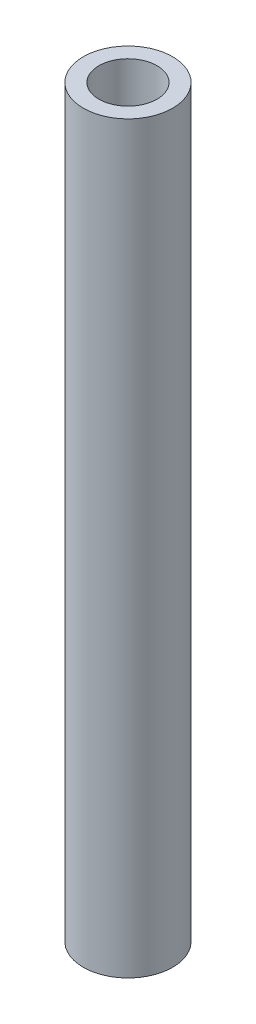
ISO-10303-21;
HEADER;
FILE_DESCRIPTION(('STEP AP214'),'2;1');
FILE_NAME('part.step','',(''),(''),'','','');
FILE_SCHEMA(('AUTOMOTIVE_DESIGN { 1 0 10303 214 1 1 1 1 }'));
ENDSEC;
DATA;
#1=APPLICATION_CONTEXT('core data for automotive mechanical design processes');
#2=APPLICATION_PROTOCOL_DEFINITION('international standard','automotive_design',2000,#1);
#3=PRODUCT_CONTEXT('',#1,'mechanical');
#4=PRODUCT('Part','Part','',(#3));
#5=PRODUCT_RELATED_PRODUCT_CATEGORY('part','',(#4));
#6=PRODUCT_DEFINITION_FORMATION('','',#4);
#7=PRODUCT_DEFINITION_CONTEXT('part definition',#1,'design');
#8=PRODUCT_DEFINITION('design','',#6,#7);
#9=PRODUCT_DEFINITION_SHAPE('','',#8);
#10=(LENGTH_UNIT() NAMED_UNIT(*) SI_UNIT(.MILLI.,.METRE.));
#11=(NAMED_UNIT(*) PLANE_ANGLE_UNIT() SI_UNIT($,.RADIAN.));
#12=(NAMED_UNIT(*) SI_UNIT($,.STERADIAN.) SOLID_ANGLE_UNIT());
#13=UNCERTAINTY_MEASURE_WITH_UNIT(LENGTH_MEASURE(1.E-05),#10,'distance_accuracy_value','');
#14=(GEOMETRIC_REPRESENTATION_CONTEXT(3) GLOBAL_UNCERTAINTY_ASSIGNED_CONTEXT((#13)) GLOBAL_UNIT_ASSIGNED_CONTEXT((#10,
#11,#12)) REPRESENTATION_CONTEXT('',''));
#15=CARTESIAN_POINT('',(0.,0.,0.));
#16=DIRECTION('',(0.,0.,1.));
#17=DIRECTION('',(1.,0.,0.));
#18=AXIS2_PLACEMENT_3D('',#15,#16,#17);
#19=CARTESIAN_POINT('',(0.,79.375,0.));
#20=DIRECTION('',(0.,1.,0.));
#21=DIRECTION('',(0.,0.,1.));
#22=AXIS2_PLACEMENT_3D('',#19,#20,#21);
#23=PLANE('',#22);
#24=CARTESIAN_POINT('',(0.,79.375,0.));
#25=DIRECTION('',(0.,1.,0.));
#26=DIRECTION('',(0.,0.,1.));
#27=AXIS2_PLACEMENT_3D('',#24,#25,#26);
#28=CIRCLE('',#27,4.7625);
#29=CARTESIAN_POINT('',(0.,79.375,4.7625));
#30=VERTEX_POINT('',#29);
#31=EDGE_CURVE('E10',#30,#30,#28,.T.);
#32=ORIENTED_EDGE('',*,*,#31,.T.);
#33=EDGE_LOOP('',(#32));
#34=FACE_BOUND('',#33,.T.);
#35=CARTESIAN_POINT('',(0.,79.375,0.));
#36=DIRECTION('',(0.,1.,0.));
#37=DIRECTION('',(0.,0.,1.));
#38=AXIS2_PLACEMENT_3D('',#35,#36,#37);
#39=CIRCLE('',#38,3.1);
#40=CARTESIAN_POINT('',(0.,79.375,3.1));
#41=VERTEX_POINT('',#40);
#42=EDGE_CURVE('E42',#41,#41,#39,.T.);
#43=ORIENTED_EDGE('',*,*,#42,.F.);
#44=EDGE_LOOP('',(#43));
#45=FACE_BOUND('',#44,.T.);
#46=ADVANCED_FACE('F31',(#34,#45),#23,.T.);
#47=CARTESIAN_POINT('',(0.,0.,0.));
#48=DIRECTION('',(0.,1.,0.));
#49=DIRECTION('',(0.,0.,1.));
#50=AXIS2_PLACEMENT_3D('',#47,#48,#49);
#51=PLANE('',#50);
#52=CARTESIAN_POINT('',(0.,0.,0.));
#53=DIRECTION('',(0.,1.,0.));
#54=DIRECTION('',(0.,0.,1.));
#55=AXIS2_PLACEMENT_3D('',#52,#53,#54);
#56=CIRCLE('',#55,4.7625);
#57=CARTESIAN_POINT('',(0.,0.,4.7625));
#58=VERTEX_POINT('',#57);
#59=EDGE_CURVE('E35',#58,#58,#56,.T.);
#60=ORIENTED_EDGE('',*,*,#59,.F.);
#61=EDGE_LOOP('',(#60));
#62=FACE_BOUND('',#61,.T.);
#63=CARTESIAN_POINT('',(0.,0.,0.));
#64=DIRECTION('',(0.,1.,0.));
#65=DIRECTION('',(0.,0.,1.));
#66=AXIS2_PLACEMENT_3D('',#63,#64,#65);
#67=CIRCLE('',#66,3.1);
#68=CARTESIAN_POINT('',(0.,0.,3.1));
#69=VERTEX_POINT('',#68);
#70=EDGE_CURVE('E44',#69,#69,#67,.T.);
#71=ORIENTED_EDGE('',*,*,#70,.T.);
#72=EDGE_LOOP('',(#71));
#73=FACE_BOUND('',#72,.T.);
#74=ADVANCED_FACE('F54',(#62,#73),#51,.F.);
#75=CARTESIAN_POINT('',(0.,79.375,0.));
#76=DIRECTION('',(0.,-1.,0.));
#77=DIRECTION('',(0.,0.,-1.));
#78=AXIS2_PLACEMENT_3D('',#75,#76,#77);
#79=CYLINDRICAL_SURFACE('',#78,4.7625);
#80=ORIENTED_EDGE('',*,*,#31,.F.);
#81=EDGE_LOOP('',(#80));
#82=FACE_BOUND('',#81,.T.);
#83=ORIENTED_EDGE('',*,*,#59,.T.);
#84=EDGE_LOOP('',(#83));
#85=FACE_BOUND('',#84,.T.);
#86=ADVANCED_FACE('F33',(#82,#85),#79,.T.);
#87=CARTESIAN_POINT('',(0.,79.375,0.));
#88=DIRECTION('',(0.,-1.,0.));
#89=DIRECTION('',(0.,0.,-1.));
#90=AXIS2_PLACEMENT_3D('',#87,#88,#89);
#91=CYLINDRICAL_SURFACE('',#90,3.1);
#92=ORIENTED_EDGE('',*,*,#42,.T.);
#93=EDGE_LOOP('',(#92));
#94=FACE_BOUND('',#93,.T.);
#95=ORIENTED_EDGE('',*,*,#70,.F.);
#96=EDGE_LOOP('',(#95));
#97=FACE_BOUND('',#96,.T.);
#98=ADVANCED_FACE('F50',(#94,#97),#91,.F.);
#99=CLOSED_SHELL('',(#46,#74,#86,#98));
#100=MANIFOLD_SOLID_BREP('B2',#99);
#101=ADVANCED_BREP_SHAPE_REPRESENTATION('',(#18,#100),#14);
#102=SHAPE_DEFINITION_REPRESENTATION(#9,#101);
ENDSEC;
END-ISO-10303-21;
